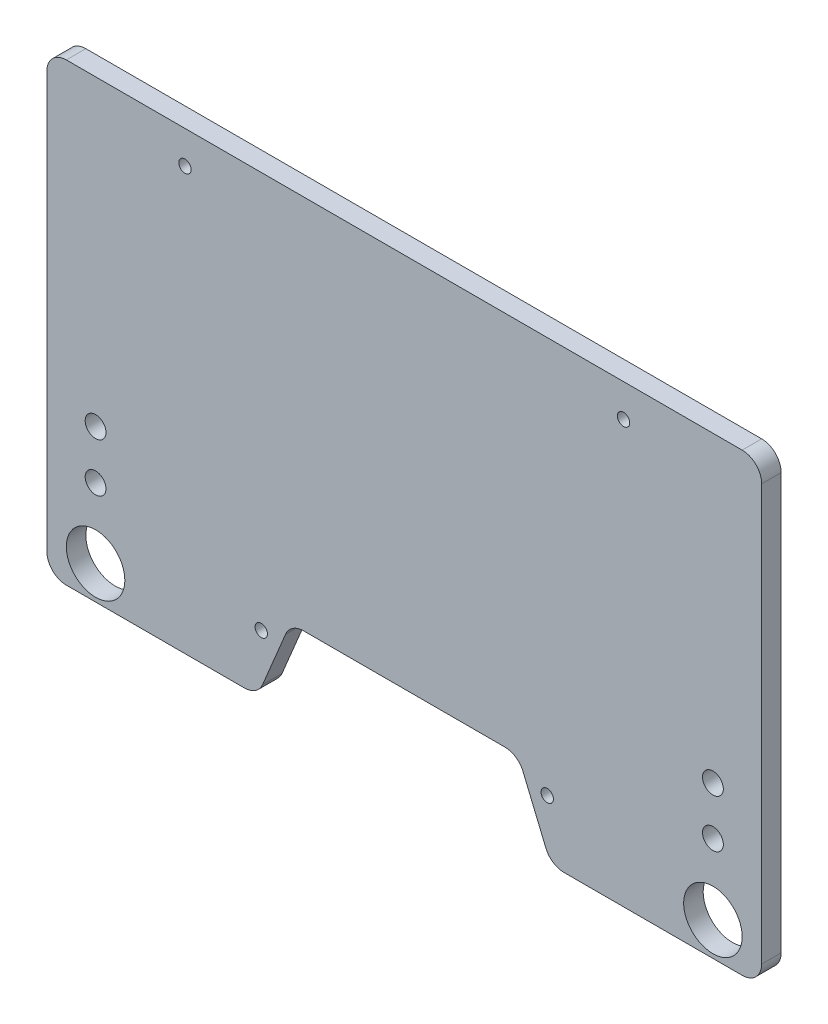
ISO-10303-21;
HEADER;
FILE_DESCRIPTION(('STEP AP214'),'2;1');
FILE_NAME('part.step','',(''),(''),'','','');
FILE_SCHEMA(('AUTOMOTIVE_DESIGN { 1 0 10303 214 1 1 1 1 }'));
ENDSEC;
DATA;
#1=APPLICATION_CONTEXT('core data for automotive mechanical design processes');
#2=APPLICATION_PROTOCOL_DEFINITION('international standard','automotive_design',2000,#1);
#3=PRODUCT_CONTEXT('',#1,'mechanical');
#4=PRODUCT('Part','Part','',(#3));
#5=PRODUCT_RELATED_PRODUCT_CATEGORY('part','',(#4));
#6=PRODUCT_DEFINITION_FORMATION('','',#4);
#7=PRODUCT_DEFINITION_CONTEXT('part definition',#1,'design');
#8=PRODUCT_DEFINITION('design','',#6,#7);
#9=PRODUCT_DEFINITION_SHAPE('','',#8);
#10=(LENGTH_UNIT() NAMED_UNIT(*) SI_UNIT(.MILLI.,.METRE.));
#11=(NAMED_UNIT(*) PLANE_ANGLE_UNIT() SI_UNIT($,.RADIAN.));
#12=(NAMED_UNIT(*) SI_UNIT($,.STERADIAN.) SOLID_ANGLE_UNIT());
#13=UNCERTAINTY_MEASURE_WITH_UNIT(LENGTH_MEASURE(1.E-05),#10,'distance_accuracy_value','');
#14=(GEOMETRIC_REPRESENTATION_CONTEXT(3) GLOBAL_UNCERTAINTY_ASSIGNED_CONTEXT((#13)) GLOBAL_UNIT_ASSIGNED_CONTEXT((#10,
#11,#12)) REPRESENTATION_CONTEXT('',''));
#15=CARTESIAN_POINT('',(0.,0.,0.));
#16=DIRECTION('',(0.,0.,1.));
#17=DIRECTION('',(1.,0.,0.));
#18=AXIS2_PLACEMENT_3D('',#15,#16,#17);
#19=CARTESIAN_POINT('',(99.5,78.1154273187962,3.));
#20=DIRECTION('',(0.,0.,-1.));
#21=DIRECTION('',(-1.,0.,0.));
#22=AXIS2_PLACEMENT_3D('',#19,#20,#21);
#23=PLANE('',#22);
#24=CARTESIAN_POINT('',(0.,16.2499999999968,3.));
#25=DIRECTION('',(0.,0.,1.));
#26=DIRECTION('',(1.,0.,0.));
#27=AXIS2_PLACEMENT_3D('',#24,#25,#26);
#28=CIRCLE('',#27,4.5);
#29=CARTESIAN_POINT('',(4.5,16.2499999999968,3.));
#30=VERTEX_POINT('',#29);
#31=EDGE_CURVE('E252',#30,#30,#28,.T.);
#32=ORIENTED_EDGE('',*,*,#31,.F.);
#33=EDGE_LOOP('',(#32));
#34=FACE_BOUND('',#33,.T.);
#35=CARTESIAN_POINT('',(95.,16.2499999999968,3.));
#36=DIRECTION('',(0.,0.,1.));
#37=DIRECTION('',(1.,0.,0.));
#38=AXIS2_PLACEMENT_3D('',#35,#36,#37);
#39=CIRCLE('',#38,4.5);
#40=CARTESIAN_POINT('',(99.5,16.2499999999968,3.));
#41=VERTEX_POINT('',#40);
#42=EDGE_CURVE('E258',#41,#41,#39,.T.);
#43=ORIENTED_EDGE('',*,*,#42,.F.);
#44=EDGE_LOOP('',(#43));
#45=FACE_BOUND('',#44,.T.);
#46=CARTESIAN_POINT('',(99.5,78.1154273187962,3.));
#47=DIRECTION('',(0.,0.,1.));
#48=DIRECTION('',(-1.,0.,0.));
#49=AXIS2_PLACEMENT_3D('',#46,#47,#48);
#50=CIRCLE('',#49,3.);
#51=CARTESIAN_POINT('',(102.5,78.1154273187962,3.));
#52=VERTEX_POINT('',#51);
#53=CARTESIAN_POINT('',(99.5,81.1154273187962,3.));
#54=VERTEX_POINT('',#53);
#55=EDGE_CURVE('E215',#52,#54,#50,.T.);
#56=ORIENTED_EDGE('',*,*,#55,.T.);
#57=DIRECTION('',(-1.,0.,0.));
#58=VECTOR('',#57,1.);
#59=CARTESIAN_POINT('',(-4.50000000000001,81.1154273187962,3.));
#60=LINE('',#59,#58);
#61=CARTESIAN_POINT('',(-4.50000000000001,81.1154273187962,3.));
#62=VERTEX_POINT('',#61);
#63=EDGE_CURVE('E121',#54,#62,#60,.T.);
#64=ORIENTED_EDGE('',*,*,#63,.T.);
#65=CARTESIAN_POINT('',(-4.50000000000001,78.1154273187962,3.));
#66=DIRECTION('',(0.,0.,1.));
#67=DIRECTION('',(1.,0.,0.));
#68=AXIS2_PLACEMENT_3D('',#65,#66,#67);
#69=CIRCLE('',#68,3.);
#70=CARTESIAN_POINT('',(-7.50000000000001,78.1154273187962,3.));
#71=VERTEX_POINT('',#70);
#72=EDGE_CURVE('E313',#62,#71,#69,.T.);
#73=ORIENTED_EDGE('',*,*,#72,.T.);
#74=DIRECTION('',(0.,-1.,0.));
#75=VECTOR('',#74,1.);
#76=CARTESIAN_POINT('',(-7.50000000000001,78.1154273187962,3.));
#77=LINE('',#76,#75);
#78=CARTESIAN_POINT('',(-7.5,14.1154273187962,3.));
#79=VERTEX_POINT('',#78);
#80=EDGE_CURVE('E315',#71,#79,#77,.T.);
#81=ORIENTED_EDGE('',*,*,#80,.T.);
#82=CARTESIAN_POINT('',(-4.5,14.1154273187962,3.));
#83=DIRECTION('',(0.,0.,1.));
#84=DIRECTION('',(1.,0.,0.));
#85=AXIS2_PLACEMENT_3D('',#82,#83,#84);
#86=CIRCLE('',#85,3.);
#87=CARTESIAN_POINT('',(-4.49999999999998,11.1154273187962,3.));
#88=VERTEX_POINT('',#87);
#89=EDGE_CURVE('E317',#79,#88,#86,.T.);
#90=ORIENTED_EDGE('',*,*,#89,.T.);
#91=DIRECTION('',(1.,0.,0.));
#92=VECTOR('',#91,1.);
#93=CARTESIAN_POINT('',(-4.49999999999998,11.1154273187962,3.));
#94=LINE('',#93,#92);
#95=CARTESIAN_POINT('',(22.9314636408157,11.1154273187962,3.));
#96=VERTEX_POINT('',#95);
#97=EDGE_CURVE('E319',#88,#96,#94,.T.);
#98=ORIENTED_EDGE('',*,*,#97,.T.);
#99=CARTESIAN_POINT('',(22.9314636408157,14.1154273187962,3.));
#100=DIRECTION('',(0.,0.,1.));
#101=DIRECTION('',(-1.,0.,0.));
#102=AXIS2_PLACEMENT_3D('',#99,#100,#101);
#103=CIRCLE('',#102,3.);
#104=CARTESIAN_POINT('',(25.7006944100464,12.9615811649499,3.));
#105=VERTEX_POINT('',#104);
#106=EDGE_CURVE('E321',#96,#105,#103,.T.);
#107=ORIENTED_EDGE('',*,*,#106,.T.);
#108=DIRECTION('',(0.384615384615421,0.923076923076908,0.));
#109=VECTOR('',#108,1.);
#110=CARTESIAN_POINT('',(28.2692307692299,19.1260684269896,3.));
#111=LINE('',#110,#109);
#112=CARTESIAN_POINT('',(29.2307692307699,21.4337607346855,3.));
#113=VERTEX_POINT('',#112);
#114=EDGE_CURVE('E323',#105,#113,#111,.T.);
#115=ORIENTED_EDGE('',*,*,#114,.T.);
#116=CARTESIAN_POINT('',(32.,20.2799145808375,3.));
#117=DIRECTION('',(0.,0.,-1.));
#118=DIRECTION('',(1.,0.,0.));
#119=AXIS2_PLACEMENT_3D('',#116,#117,#118);
#120=CIRCLE('',#119,3.00000000000002);
#121=CARTESIAN_POINT('',(32.,23.2799145808375,3.));
#122=VERTEX_POINT('',#121);
#123=EDGE_CURVE('E325',#113,#122,#120,.T.);
#124=ORIENTED_EDGE('',*,*,#123,.T.);
#125=DIRECTION('',(1.,0.,0.));
#126=VECTOR('',#125,1.);
#127=CARTESIAN_POINT('',(32.,23.2799145808375,3.));
#128=LINE('',#127,#126);
#129=CARTESIAN_POINT('',(63.,23.2799145808375,3.));
#130=VERTEX_POINT('',#129);
#131=EDGE_CURVE('E327',#122,#130,#128,.T.);
#132=ORIENTED_EDGE('',*,*,#131,.T.);
#133=CARTESIAN_POINT('',(63.,20.2799145808375,3.));
#134=DIRECTION('',(0.,0.,-1.));
#135=DIRECTION('',(1.,0.,0.));
#136=AXIS2_PLACEMENT_3D('',#133,#134,#135);
#137=CIRCLE('',#136,2.99999999999994);
#138=CARTESIAN_POINT('',(65.7692307692299,21.4337607346854,3.));
#139=VERTEX_POINT('',#138);
#140=EDGE_CURVE('E329',#130,#139,#137,.T.);
#141=ORIENTED_EDGE('',*,*,#140,.T.);
#142=DIRECTION('',(0.384615384615432,-0.923076923076903,0.));
#143=VECTOR('',#142,1.);
#144=CARTESIAN_POINT('',(65.7692307692299,21.4337607346854,3.));
#145=LINE('',#144,#143);
#146=CARTESIAN_POINT('',(69.2993055899535,12.9615811649499,3.));
#147=VERTEX_POINT('',#146);
#148=EDGE_CURVE('E331',#139,#147,#145,.T.);
#149=ORIENTED_EDGE('',*,*,#148,.T.);
#150=CARTESIAN_POINT('',(72.0685363591843,14.1154273187962,3.));
#151=DIRECTION('',(0.,0.,1.));
#152=DIRECTION('',(1.,0.,0.));
#153=AXIS2_PLACEMENT_3D('',#150,#151,#152);
#154=CIRCLE('',#153,3.);
#155=CARTESIAN_POINT('',(72.0685363591843,11.1154273187962,3.));
#156=VERTEX_POINT('',#155);
#157=EDGE_CURVE('E164',#147,#156,#154,.T.);
#158=ORIENTED_EDGE('',*,*,#157,.T.);
#159=DIRECTION('',(1.,0.,0.));
#160=VECTOR('',#159,1.);
#161=CARTESIAN_POINT('',(72.0685363591843,11.1154273187962,3.));
#162=LINE('',#161,#160);
#163=CARTESIAN_POINT('',(99.5,11.1154273187962,3.));
#164=VERTEX_POINT('',#163);
#165=EDGE_CURVE('E158',#156,#164,#162,.T.);
#166=ORIENTED_EDGE('',*,*,#165,.T.);
#167=CARTESIAN_POINT('',(99.5,14.1154273187962,3.));
#168=DIRECTION('',(0.,0.,1.));
#169=DIRECTION('',(1.,0.,0.));
#170=AXIS2_PLACEMENT_3D('',#167,#168,#169);
#171=CIRCLE('',#170,3.);
#172=CARTESIAN_POINT('',(102.5,14.1154273187962,3.));
#173=VERTEX_POINT('',#172);
#174=EDGE_CURVE('E162',#164,#173,#171,.T.);
#175=ORIENTED_EDGE('',*,*,#174,.T.);
#176=DIRECTION('',(0.,1.,0.));
#177=VECTOR('',#176,1.);
#178=CARTESIAN_POINT('',(102.5,78.1154273187962,3.));
#179=LINE('',#178,#177);
#180=EDGE_CURVE('E54',#173,#52,#179,.T.);
#181=ORIENTED_EDGE('',*,*,#180,.T.);
#182=EDGE_LOOP('',(#56,#64,#73,#81,#90,#98,#107,#115,#124,#132,#141,#149,#158,#166,#175,#181));
#183=FACE_BOUND('',#182,.T.);
#184=CARTESIAN_POINT('',(0.,34.4999999999959,3.));
#185=DIRECTION('',(0.,0.,1.));
#186=DIRECTION('',(1.,0.,0.));
#187=AXIS2_PLACEMENT_3D('',#184,#185,#186);
#188=CIRCLE('',#187,1.6);
#189=CARTESIAN_POINT('',(1.6,34.4999999999959,3.));
#190=VERTEX_POINT('',#189);
#191=EDGE_CURVE('E186',#190,#190,#188,.T.);
#192=ORIENTED_EDGE('',*,*,#191,.F.);
#193=EDGE_LOOP('',(#192));
#194=FACE_BOUND('',#193,.T.);
#195=CARTESIAN_POINT('',(0.,26.9999999999979,3.));
#196=DIRECTION('',(0.,0.,1.));
#197=DIRECTION('',(1.,0.,0.));
#198=AXIS2_PLACEMENT_3D('',#195,#196,#197);
#199=CIRCLE('',#198,1.6);
#200=CARTESIAN_POINT('',(1.6,26.9999999999979,3.));
#201=VERTEX_POINT('',#200);
#202=EDGE_CURVE('E301',#201,#201,#199,.T.);
#203=ORIENTED_EDGE('',*,*,#202,.F.);
#204=EDGE_LOOP('',(#203));
#205=FACE_BOUND('',#204,.T.);
#206=CARTESIAN_POINT('',(95.,34.4999999999959,3.));
#207=DIRECTION('',(0.,0.,1.));
#208=DIRECTION('',(1.,0.,0.));
#209=AXIS2_PLACEMENT_3D('',#206,#207,#208);
#210=CIRCLE('',#209,1.60000000000001);
#211=CARTESIAN_POINT('',(96.6,34.4999999999959,3.));
#212=VERTEX_POINT('',#211);
#213=EDGE_CURVE('E295',#212,#212,#210,.T.);
#214=ORIENTED_EDGE('',*,*,#213,.F.);
#215=EDGE_LOOP('',(#214));
#216=FACE_BOUND('',#215,.T.);
#217=CARTESIAN_POINT('',(95.,27.1000000000248,3.));
#218=DIRECTION('',(0.,0.,1.));
#219=DIRECTION('',(1.,0.,0.));
#220=AXIS2_PLACEMENT_3D('',#217,#218,#219);
#221=CIRCLE('',#220,1.6);
#222=CARTESIAN_POINT('',(96.6,27.1000000000248,3.));
#223=VERTEX_POINT('',#222);
#224=EDGE_CURVE('E289',#223,#223,#221,.T.);
#225=ORIENTED_EDGE('',*,*,#224,.F.);
#226=EDGE_LOOP('',(#225));
#227=FACE_BOUND('',#226,.T.);
#228=CARTESIAN_POINT('',(13.75,76.0799145808375,3.));
#229=DIRECTION('',(0.,0.,1.));
#230=DIRECTION('',(1.,0.,0.));
#231=AXIS2_PLACEMENT_3D('',#228,#229,#230);
#232=CIRCLE('',#231,0.950000000000001);
#233=CARTESIAN_POINT('',(14.7,76.0799145808375,3.));
#234=VERTEX_POINT('',#233);
#235=EDGE_CURVE('E283',#234,#234,#232,.T.);
#236=ORIENTED_EDGE('',*,*,#235,.F.);
#237=EDGE_LOOP('',(#236));
#238=FACE_BOUND('',#237,.T.);
#239=CARTESIAN_POINT('',(81.25,76.0799145808375,3.));
#240=DIRECTION('',(0.,0.,1.));
#241=DIRECTION('',(1.,0.,0.));
#242=AXIS2_PLACEMENT_3D('',#239,#240,#241);
#243=CIRCLE('',#242,0.950000000000003);
#244=CARTESIAN_POINT('',(82.2,76.0799145808375,3.));
#245=VERTEX_POINT('',#244);
#246=EDGE_CURVE('E277',#245,#245,#243,.T.);
#247=ORIENTED_EDGE('',*,*,#246,.F.);
#248=EDGE_LOOP('',(#247));
#249=FACE_BOUND('',#248,.T.);
#250=CARTESIAN_POINT('',(69.5,20.0799145808375,3.));
#251=DIRECTION('',(0.,0.,1.));
#252=DIRECTION('',(1.,0.,0.));
#253=AXIS2_PLACEMENT_3D('',#250,#251,#252);
#254=CIRCLE('',#253,0.950000000000002);
#255=CARTESIAN_POINT('',(70.45,20.0799145808375,3.));
#256=VERTEX_POINT('',#255);
#257=EDGE_CURVE('E271',#256,#256,#254,.T.);
#258=ORIENTED_EDGE('',*,*,#257,.F.);
#259=EDGE_LOOP('',(#258));
#260=FACE_BOUND('',#259,.T.);
#261=CARTESIAN_POINT('',(25.5,20.0799145808375,3.));
#262=DIRECTION('',(0.,0.,1.));
#263=DIRECTION('',(1.,0.,0.));
#264=AXIS2_PLACEMENT_3D('',#261,#262,#263);
#265=CIRCLE('',#264,0.950000000000001);
#266=CARTESIAN_POINT('',(26.45,20.0799145808375,3.));
#267=VERTEX_POINT('',#266);
#268=EDGE_CURVE('E265',#267,#267,#265,.T.);
#269=ORIENTED_EDGE('',*,*,#268,.F.);
#270=EDGE_LOOP('',(#269));
#271=FACE_BOUND('',#270,.T.);
#272=ADVANCED_FACE('F35',(#34,#45,#183,#194,#205,#216,#227,#238,#249,#260,#271),#23,.F.);
#273=CARTESIAN_POINT('',(99.5,78.1154273187962,0.));
#274=DIRECTION('',(0.,0.,-1.));
#275=DIRECTION('',(-1.,0.,0.));
#276=AXIS2_PLACEMENT_3D('',#273,#274,#275);
#277=PLANE('',#276);
#278=CARTESIAN_POINT('',(0.,16.2499999999968,0.));
#279=DIRECTION('',(0.,0.,-1.));
#280=DIRECTION('',(-1.,0.,0.));
#281=AXIS2_PLACEMENT_3D('',#278,#279,#280);
#282=CIRCLE('',#281,4.5);
#283=CARTESIAN_POINT('',(-4.5,16.2499999999968,0.));
#284=VERTEX_POINT('',#283);
#285=EDGE_CURVE('E39',#284,#284,#282,.T.);
#286=ORIENTED_EDGE('',*,*,#285,.F.);
#287=EDGE_LOOP('',(#286));
#288=FACE_BOUND('',#287,.T.);
#289=CARTESIAN_POINT('',(95.,16.2499999999968,0.));
#290=DIRECTION('',(0.,0.,-1.));
#291=DIRECTION('',(-1.,0.,0.));
#292=AXIS2_PLACEMENT_3D('',#289,#290,#291);
#293=CIRCLE('',#292,4.5);
#294=CARTESIAN_POINT('',(90.5,16.2499999999968,0.));
#295=VERTEX_POINT('',#294);
#296=EDGE_CURVE('E250',#295,#295,#293,.T.);
#297=ORIENTED_EDGE('',*,*,#296,.F.);
#298=EDGE_LOOP('',(#297));
#299=FACE_BOUND('',#298,.T.);
#300=CARTESIAN_POINT('',(69.5,20.0799145808375,0.));
#301=DIRECTION('',(0.,0.,1.));
#302=DIRECTION('',(1.,0.,0.));
#303=AXIS2_PLACEMENT_3D('',#300,#301,#302);
#304=CIRCLE('',#303,0.950000000000002);
#305=CARTESIAN_POINT('',(70.45,20.0799145808375,0.));
#306=VERTEX_POINT('',#305);
#307=EDGE_CURVE('E268',#306,#306,#304,.T.);
#308=ORIENTED_EDGE('',*,*,#307,.T.);
#309=EDGE_LOOP('',(#308));
#310=FACE_BOUND('',#309,.T.);
#311=CARTESIAN_POINT('',(13.75,76.0799145808375,0.));
#312=DIRECTION('',(0.,0.,1.));
#313=DIRECTION('',(1.,0.,0.));
#314=AXIS2_PLACEMENT_3D('',#311,#312,#313);
#315=CIRCLE('',#314,0.950000000000001);
#316=CARTESIAN_POINT('',(14.7,76.0799145808375,0.));
#317=VERTEX_POINT('',#316);
#318=EDGE_CURVE('E280',#317,#317,#315,.T.);
#319=ORIENTED_EDGE('',*,*,#318,.T.);
#320=EDGE_LOOP('',(#319));
#321=FACE_BOUND('',#320,.T.);
#322=CARTESIAN_POINT('',(95.,34.4999999999959,0.));
#323=DIRECTION('',(0.,0.,1.));
#324=DIRECTION('',(1.,0.,0.));
#325=AXIS2_PLACEMENT_3D('',#322,#323,#324);
#326=CIRCLE('',#325,1.60000000000001);
#327=CARTESIAN_POINT('',(96.6,34.4999999999959,0.));
#328=VERTEX_POINT('',#327);
#329=EDGE_CURVE('E292',#328,#328,#326,.T.);
#330=ORIENTED_EDGE('',*,*,#329,.T.);
#331=EDGE_LOOP('',(#330));
#332=FACE_BOUND('',#331,.T.);
#333=CARTESIAN_POINT('',(0.,34.4999999999959,0.));
#334=DIRECTION('',(0.,0.,1.));
#335=DIRECTION('',(1.,0.,0.));
#336=AXIS2_PLACEMENT_3D('',#333,#334,#335);
#337=CIRCLE('',#336,1.6);
#338=CARTESIAN_POINT('',(1.6,34.4999999999959,0.));
#339=VERTEX_POINT('',#338);
#340=EDGE_CURVE('E304',#339,#339,#337,.T.);
#341=ORIENTED_EDGE('',*,*,#340,.T.);
#342=EDGE_LOOP('',(#341));
#343=FACE_BOUND('',#342,.T.);
#344=CARTESIAN_POINT('',(99.5,78.1154273187962,0.));
#345=DIRECTION('',(0.,0.,1.));
#346=DIRECTION('',(-1.,0.,0.));
#347=AXIS2_PLACEMENT_3D('',#344,#345,#346);
#348=CIRCLE('',#347,3.);
#349=CARTESIAN_POINT('',(102.5,78.1154273187962,0.));
#350=VERTEX_POINT('',#349);
#351=CARTESIAN_POINT('',(99.5,81.1154273187962,0.));
#352=VERTEX_POINT('',#351);
#353=EDGE_CURVE('E182',#350,#352,#348,.T.);
#354=ORIENTED_EDGE('',*,*,#353,.F.);
#355=DIRECTION('',(0.,1.,0.));
#356=VECTOR('',#355,1.);
#357=CARTESIAN_POINT('',(102.5,78.1154273187962,0.));
#358=LINE('',#357,#356);
#359=CARTESIAN_POINT('',(102.5,14.1154273187962,0.));
#360=VERTEX_POINT('',#359);
#361=EDGE_CURVE('E113',#360,#350,#358,.T.);
#362=ORIENTED_EDGE('',*,*,#361,.F.);
#363=CARTESIAN_POINT('',(99.5,14.1154273187962,0.));
#364=DIRECTION('',(0.,0.,1.));
#365=DIRECTION('',(1.,0.,0.));
#366=AXIS2_PLACEMENT_3D('',#363,#364,#365);
#367=CIRCLE('',#366,3.);
#368=CARTESIAN_POINT('',(99.5,11.1154273187962,0.));
#369=VERTEX_POINT('',#368);
#370=EDGE_CURVE('E107',#369,#360,#367,.T.);
#371=ORIENTED_EDGE('',*,*,#370,.F.);
#372=DIRECTION('',(1.,0.,0.));
#373=VECTOR('',#372,1.);
#374=CARTESIAN_POINT('',(72.0685363591843,11.1154273187962,0.));
#375=LINE('',#374,#373);
#376=CARTESIAN_POINT('',(72.0685363591843,11.1154273187962,0.));
#377=VERTEX_POINT('',#376);
#378=EDGE_CURVE('E172',#377,#369,#375,.T.);
#379=ORIENTED_EDGE('',*,*,#378,.F.);
#380=CARTESIAN_POINT('',(72.0685363591843,14.1154273187962,0.));
#381=DIRECTION('',(0.,0.,1.));
#382=DIRECTION('',(1.,0.,0.));
#383=AXIS2_PLACEMENT_3D('',#380,#381,#382);
#384=CIRCLE('',#383,3.);
#385=CARTESIAN_POINT('',(69.2993055899535,12.9615811649499,0.));
#386=VERTEX_POINT('',#385);
#387=EDGE_CURVE('E210',#386,#377,#384,.T.);
#388=ORIENTED_EDGE('',*,*,#387,.F.);
#389=DIRECTION('',(0.384615384615432,-0.923076923076903,0.));
#390=VECTOR('',#389,1.);
#391=CARTESIAN_POINT('',(66.7307692307682,19.1260684269938,0.));
#392=LINE('',#391,#390);
#393=CARTESIAN_POINT('',(65.7692307692299,21.4337607346854,0.));
#394=VERTEX_POINT('',#393);
#395=EDGE_CURVE('E208',#394,#386,#392,.T.);
#396=ORIENTED_EDGE('',*,*,#395,.F.);
#397=CARTESIAN_POINT('',(63.,20.2799145808375,0.));
#398=DIRECTION('',(0.,0.,-1.));
#399=DIRECTION('',(1.,0.,0.));
#400=AXIS2_PLACEMENT_3D('',#397,#398,#399);
#401=CIRCLE('',#400,2.99999999999994);
#402=CARTESIAN_POINT('',(63.,23.2799145808375,0.));
#403=VERTEX_POINT('',#402);
#404=EDGE_CURVE('E205',#403,#394,#401,.T.);
#405=ORIENTED_EDGE('',*,*,#404,.F.);
#406=DIRECTION('',(1.,0.,0.));
#407=VECTOR('',#406,1.);
#408=CARTESIAN_POINT('',(32.,23.2799145808375,0.));
#409=LINE('',#408,#407);
#410=CARTESIAN_POINT('',(32.,23.2799145808375,0.));
#411=VERTEX_POINT('',#410);
#412=EDGE_CURVE('E203',#411,#403,#409,.T.);
#413=ORIENTED_EDGE('',*,*,#412,.F.);
#414=CARTESIAN_POINT('',(32.,20.2799145808375,0.));
#415=DIRECTION('',(0.,0.,-1.));
#416=DIRECTION('',(1.,0.,0.));
#417=AXIS2_PLACEMENT_3D('',#414,#415,#416);
#418=CIRCLE('',#417,3.00000000000002);
#419=CARTESIAN_POINT('',(29.2307692307699,21.4337607346855,0.));
#420=VERTEX_POINT('',#419);
#421=EDGE_CURVE('E201',#420,#411,#418,.T.);
#422=ORIENTED_EDGE('',*,*,#421,.F.);
#423=DIRECTION('',(0.384615384615422,0.923076923076908,0.));
#424=VECTOR('',#423,1.);
#425=CARTESIAN_POINT('',(28.2692307692299,19.1260684269896,0.));
#426=LINE('',#425,#424);
#427=CARTESIAN_POINT('',(25.7006944100464,12.9615811649499,0.));
#428=VERTEX_POINT('',#427);
#429=EDGE_CURVE('E199',#428,#420,#426,.T.);
#430=ORIENTED_EDGE('',*,*,#429,.F.);
#431=CARTESIAN_POINT('',(22.9314636408157,14.1154273187962,0.));
#432=DIRECTION('',(0.,0.,1.));
#433=DIRECTION('',(-1.,0.,0.));
#434=AXIS2_PLACEMENT_3D('',#431,#432,#433);
#435=CIRCLE('',#434,3.);
#436=CARTESIAN_POINT('',(22.9314636408157,11.1154273187962,0.));
#437=VERTEX_POINT('',#436);
#438=EDGE_CURVE('E196',#437,#428,#435,.T.);
#439=ORIENTED_EDGE('',*,*,#438,.F.);
#440=DIRECTION('',(1.,0.,0.));
#441=VECTOR('',#440,1.);
#442=CARTESIAN_POINT('',(-4.49999999999998,11.1154273187962,0.));
#443=LINE('',#442,#441);
#444=CARTESIAN_POINT('',(-4.49999999999998,11.1154273187962,0.));
#445=VERTEX_POINT('',#444);
#446=EDGE_CURVE('E194',#445,#437,#443,.T.);
#447=ORIENTED_EDGE('',*,*,#446,.F.);
#448=CARTESIAN_POINT('',(-4.5,14.1154273187962,0.));
#449=DIRECTION('',(0.,0.,1.));
#450=DIRECTION('',(1.,0.,0.));
#451=AXIS2_PLACEMENT_3D('',#448,#449,#450);
#452=CIRCLE('',#451,3.);
#453=CARTESIAN_POINT('',(-7.5,14.1154273187962,0.));
#454=VERTEX_POINT('',#453);
#455=EDGE_CURVE('E192',#454,#445,#452,.T.);
#456=ORIENTED_EDGE('',*,*,#455,.F.);
#457=DIRECTION('',(0.,-1.,0.));
#458=VECTOR('',#457,1.);
#459=CARTESIAN_POINT('',(-7.50000000000001,78.1154273187962,0.));
#460=LINE('',#459,#458);
#461=CARTESIAN_POINT('',(-7.50000000000001,78.1154273187962,0.));
#462=VERTEX_POINT('',#461);
#463=EDGE_CURVE('E190',#462,#454,#460,.T.);
#464=ORIENTED_EDGE('',*,*,#463,.F.);
#465=CARTESIAN_POINT('',(-4.50000000000001,78.1154273187962,0.));
#466=DIRECTION('',(0.,0.,1.));
#467=DIRECTION('',(1.,0.,0.));
#468=AXIS2_PLACEMENT_3D('',#465,#466,#467);
#469=CIRCLE('',#468,3.);
#470=CARTESIAN_POINT('',(-4.50000000000001,81.1154273187962,0.));
#471=VERTEX_POINT('',#470);
#472=EDGE_CURVE('E188',#471,#462,#469,.T.);
#473=ORIENTED_EDGE('',*,*,#472,.F.);
#474=DIRECTION('',(-1.,0.,0.));
#475=VECTOR('',#474,1.);
#476=CARTESIAN_POINT('',(-4.50000000000001,81.1154273187962,0.));
#477=LINE('',#476,#475);
#478=EDGE_CURVE('E185',#352,#471,#477,.T.);
#479=ORIENTED_EDGE('',*,*,#478,.F.);
#480=EDGE_LOOP('',(#354,#362,#371,#379,#388,#396,#405,#413,#422,#430,#439,#447,#456,#464,#473,#479));
#481=FACE_BOUND('',#480,.T.);
#482=CARTESIAN_POINT('',(0.,26.9999999999979,0.));
#483=DIRECTION('',(0.,0.,1.));
#484=DIRECTION('',(1.,0.,0.));
#485=AXIS2_PLACEMENT_3D('',#482,#483,#484);
#486=CIRCLE('',#485,1.6);
#487=CARTESIAN_POINT('',(1.6,26.9999999999979,0.));
#488=VERTEX_POINT('',#487);
#489=EDGE_CURVE('E298',#488,#488,#486,.T.);
#490=ORIENTED_EDGE('',*,*,#489,.T.);
#491=EDGE_LOOP('',(#490));
#492=FACE_BOUND('',#491,.T.);
#493=CARTESIAN_POINT('',(95.,27.1000000000248,0.));
#494=DIRECTION('',(0.,0.,1.));
#495=DIRECTION('',(1.,0.,0.));
#496=AXIS2_PLACEMENT_3D('',#493,#494,#495);
#497=CIRCLE('',#496,1.6);
#498=CARTESIAN_POINT('',(96.6,27.1000000000248,0.));
#499=VERTEX_POINT('',#498);
#500=EDGE_CURVE('E286',#499,#499,#497,.T.);
#501=ORIENTED_EDGE('',*,*,#500,.T.);
#502=EDGE_LOOP('',(#501));
#503=FACE_BOUND('',#502,.T.);
#504=CARTESIAN_POINT('',(81.25,76.0799145808375,0.));
#505=DIRECTION('',(0.,0.,1.));
#506=DIRECTION('',(1.,0.,0.));
#507=AXIS2_PLACEMENT_3D('',#504,#505,#506);
#508=CIRCLE('',#507,0.950000000000003);
#509=CARTESIAN_POINT('',(82.2,76.0799145808375,0.));
#510=VERTEX_POINT('',#509);
#511=EDGE_CURVE('E274',#510,#510,#508,.T.);
#512=ORIENTED_EDGE('',*,*,#511,.T.);
#513=EDGE_LOOP('',(#512));
#514=FACE_BOUND('',#513,.T.);
#515=CARTESIAN_POINT('',(25.5,20.0799145808375,0.));
#516=DIRECTION('',(0.,0.,1.));
#517=DIRECTION('',(1.,0.,0.));
#518=AXIS2_PLACEMENT_3D('',#515,#516,#517);
#519=CIRCLE('',#518,0.950000000000001);
#520=CARTESIAN_POINT('',(26.45,20.0799145808375,0.));
#521=VERTEX_POINT('',#520);
#522=EDGE_CURVE('E256',#521,#521,#519,.T.);
#523=ORIENTED_EDGE('',*,*,#522,.T.);
#524=EDGE_LOOP('',(#523));
#525=FACE_BOUND('',#524,.T.);
#526=ADVANCED_FACE('F343',(#288,#299,#310,#321,#332,#343,#481,#492,#503,#514,#525),#277,.T.);
#527=CARTESIAN_POINT('',(99.5,78.1154273187962,3.));
#528=DIRECTION('',(0.,0.,-1.));
#529=DIRECTION('',(-1.,0.,0.));
#530=AXIS2_PLACEMENT_3D('',#527,#528,#529);
#531=CYLINDRICAL_SURFACE('',#530,3.);
#532=ORIENTED_EDGE('',*,*,#353,.T.);
#533=DIRECTION('',(0.,0.,-1.));
#534=VECTOR('',#533,1.);
#535=CARTESIAN_POINT('',(99.5,81.1154273187962,3.));
#536=LINE('',#535,#534);
#537=EDGE_CURVE('E11',#54,#352,#536,.T.);
#538=ORIENTED_EDGE('',*,*,#537,.F.);
#539=ORIENTED_EDGE('',*,*,#55,.F.);
#540=DIRECTION('',(0.,0.,-1.));
#541=VECTOR('',#540,1.);
#542=CARTESIAN_POINT('',(102.5,78.1154273187962,3.));
#543=LINE('',#542,#541);
#544=EDGE_CURVE('E178',#52,#350,#543,.T.);
#545=ORIENTED_EDGE('',*,*,#544,.T.);
#546=EDGE_LOOP('',(#532,#538,#539,#545));
#547=FACE_BOUND('',#546,.T.);
#548=ADVANCED_FACE('F37',(#547),#531,.T.);
#549=CARTESIAN_POINT('',(-4.50000000000001,81.1154273187962,3.));
#550=DIRECTION('',(0.,-1.,0.));
#551=DIRECTION('',(0.,0.,-1.));
#552=AXIS2_PLACEMENT_3D('',#549,#550,#551);
#553=PLANE('',#552);
#554=ORIENTED_EDGE('',*,*,#478,.T.);
#555=DIRECTION('',(0.,0.,-1.));
#556=VECTOR('',#555,1.);
#557=CARTESIAN_POINT('',(-4.50000000000001,81.1154273187962,3.));
#558=LINE('',#557,#556);
#559=EDGE_CURVE('E45',#62,#471,#558,.T.);
#560=ORIENTED_EDGE('',*,*,#559,.F.);
#561=ORIENTED_EDGE('',*,*,#63,.F.);
#562=ORIENTED_EDGE('',*,*,#537,.T.);
#563=EDGE_LOOP('',(#554,#560,#561,#562));
#564=FACE_BOUND('',#563,.T.);
#565=ADVANCED_FACE('F582',(#564),#553,.F.);
#566=CARTESIAN_POINT('',(-4.50000000000001,78.1154273187962,3.));
#567=DIRECTION('',(0.,0.,-1.));
#568=DIRECTION('',(-1.,0.,0.));
#569=AXIS2_PLACEMENT_3D('',#566,#567,#568);
#570=CYLINDRICAL_SURFACE('',#569,3.);
#571=ORIENTED_EDGE('',*,*,#472,.T.);
#572=DIRECTION('',(0.,0.,-1.));
#573=VECTOR('',#572,1.);
#574=CARTESIAN_POINT('',(-7.50000000000001,78.1154273187962,3.));
#575=LINE('',#574,#573);
#576=EDGE_CURVE('E246',#71,#462,#575,.T.);
#577=ORIENTED_EDGE('',*,*,#576,.F.);
#578=ORIENTED_EDGE('',*,*,#72,.F.);
#579=ORIENTED_EDGE('',*,*,#559,.T.);
#580=EDGE_LOOP('',(#571,#577,#578,#579));
#581=FACE_BOUND('',#580,.T.);
#582=ADVANCED_FACE('F572',(#581),#570,.T.);
#583=CARTESIAN_POINT('',(-7.50000000000001,78.1154273187962,3.));
#584=DIRECTION('',(1.,0.,0.));
#585=DIRECTION('',(0.,1.,0.));
#586=AXIS2_PLACEMENT_3D('',#583,#584,#585);
#587=PLANE('',#586);
#588=ORIENTED_EDGE('',*,*,#463,.T.);
#589=DIRECTION('',(0.,0.,-1.));
#590=VECTOR('',#589,1.);
#591=CARTESIAN_POINT('',(-7.5,14.1154273187962,3.));
#592=LINE('',#591,#590);
#593=EDGE_CURVE('E243',#79,#454,#592,.T.);
#594=ORIENTED_EDGE('',*,*,#593,.F.);
#595=ORIENTED_EDGE('',*,*,#80,.F.);
#596=ORIENTED_EDGE('',*,*,#576,.T.);
#597=EDGE_LOOP('',(#588,#594,#595,#596));
#598=FACE_BOUND('',#597,.T.);
#599=ADVANCED_FACE('F562',(#598),#587,.F.);
#600=CARTESIAN_POINT('',(-4.5,14.1154273187962,3.));
#601=DIRECTION('',(0.,0.,-1.));
#602=DIRECTION('',(-1.,0.,0.));
#603=AXIS2_PLACEMENT_3D('',#600,#601,#602);
#604=CYLINDRICAL_SURFACE('',#603,3.);
#605=ORIENTED_EDGE('',*,*,#455,.T.);
#606=DIRECTION('',(0.,0.,-1.));
#607=VECTOR('',#606,1.);
#608=CARTESIAN_POINT('',(-4.49999999999998,11.1154273187962,3.));
#609=LINE('',#608,#607);
#610=EDGE_CURVE('E240',#88,#445,#609,.T.);
#611=ORIENTED_EDGE('',*,*,#610,.F.);
#612=ORIENTED_EDGE('',*,*,#89,.F.);
#613=ORIENTED_EDGE('',*,*,#593,.T.);
#614=EDGE_LOOP('',(#605,#611,#612,#613));
#615=FACE_BOUND('',#614,.T.);
#616=ADVANCED_FACE('F552',(#615),#604,.T.);
#617=CARTESIAN_POINT('',(-4.49999999999998,11.1154273187962,3.));
#618=DIRECTION('',(0.,1.,0.));
#619=DIRECTION('',(0.,0.,1.));
#620=AXIS2_PLACEMENT_3D('',#617,#618,#619);
#621=PLANE('',#620);
#622=ORIENTED_EDGE('',*,*,#446,.T.);
#623=DIRECTION('',(0.,0.,-1.));
#624=VECTOR('',#623,1.);
#625=CARTESIAN_POINT('',(22.9314636408157,11.1154273187962,3.));
#626=LINE('',#625,#624);
#627=EDGE_CURVE('E237',#96,#437,#626,.T.);
#628=ORIENTED_EDGE('',*,*,#627,.F.);
#629=ORIENTED_EDGE('',*,*,#97,.F.);
#630=ORIENTED_EDGE('',*,*,#610,.T.);
#631=EDGE_LOOP('',(#622,#628,#629,#630));
#632=FACE_BOUND('',#631,.T.);
#633=ADVANCED_FACE('F542',(#632),#621,.F.);
#634=CARTESIAN_POINT('',(22.9314636408157,14.1154273187962,3.));
#635=DIRECTION('',(0.,0.,-1.));
#636=DIRECTION('',(-1.,0.,0.));
#637=AXIS2_PLACEMENT_3D('',#634,#635,#636);
#638=CYLINDRICAL_SURFACE('',#637,3.);
#639=ORIENTED_EDGE('',*,*,#438,.T.);
#640=DIRECTION('',(0.,0.,-1.));
#641=VECTOR('',#640,1.);
#642=CARTESIAN_POINT('',(25.7006944100464,12.9615811649499,3.));
#643=LINE('',#642,#641);
#644=EDGE_CURVE('E234',#105,#428,#643,.T.);
#645=ORIENTED_EDGE('',*,*,#644,.F.);
#646=ORIENTED_EDGE('',*,*,#106,.F.);
#647=ORIENTED_EDGE('',*,*,#627,.T.);
#648=EDGE_LOOP('',(#639,#645,#646,#647));
#649=FACE_BOUND('',#648,.T.);
#650=ADVANCED_FACE('F531',(#649),#638,.T.);
#651=CARTESIAN_POINT('',(28.2692307692299,19.1260684269896,3.));
#652=DIRECTION('',(-0.923076923076907,0.384615384615422,0.));
#653=DIRECTION('',(-0.384615384615422,-0.923076923076907,0.));
#654=AXIS2_PLACEMENT_3D('',#651,#652,#653);
#655=PLANE('',#654);
#656=ORIENTED_EDGE('',*,*,#429,.T.);
#657=DIRECTION('',(0.,0.,-1.));
#658=VECTOR('',#657,1.);
#659=CARTESIAN_POINT('',(29.2307692307699,21.4337607346855,3.));
#660=LINE('',#659,#658);
#661=EDGE_CURVE('E231',#113,#420,#660,.T.);
#662=ORIENTED_EDGE('',*,*,#661,.F.);
#663=ORIENTED_EDGE('',*,*,#114,.F.);
#664=ORIENTED_EDGE('',*,*,#644,.T.);
#665=EDGE_LOOP('',(#656,#662,#663,#664));
#666=FACE_BOUND('',#665,.T.);
#667=ADVANCED_FACE('F521',(#666),#655,.F.);
#668=CARTESIAN_POINT('',(32.,20.2799145808375,3.));
#669=DIRECTION('',(0.,0.,-1.));
#670=DIRECTION('',(-1.,0.,0.));
#671=AXIS2_PLACEMENT_3D('',#668,#669,#670);
#672=CYLINDRICAL_SURFACE('',#671,3.00000000000002);
#673=ORIENTED_EDGE('',*,*,#421,.T.);
#674=DIRECTION('',(0.,0.,-1.));
#675=VECTOR('',#674,1.);
#676=CARTESIAN_POINT('',(32.,23.2799145808375,3.));
#677=LINE('',#676,#675);
#678=EDGE_CURVE('E228',#122,#411,#677,.T.);
#679=ORIENTED_EDGE('',*,*,#678,.F.);
#680=ORIENTED_EDGE('',*,*,#123,.F.);
#681=ORIENTED_EDGE('',*,*,#661,.T.);
#682=EDGE_LOOP('',(#673,#679,#680,#681));
#683=FACE_BOUND('',#682,.T.);
#684=ADVANCED_FACE('F511',(#683),#672,.F.);
#685=CARTESIAN_POINT('',(32.,23.2799145808375,3.));
#686=DIRECTION('',(0.,1.,0.));
#687=DIRECTION('',(0.,0.,1.));
#688=AXIS2_PLACEMENT_3D('',#685,#686,#687);
#689=PLANE('',#688);
#690=ORIENTED_EDGE('',*,*,#412,.T.);
#691=DIRECTION('',(0.,0.,-1.));
#692=VECTOR('',#691,1.);
#693=CARTESIAN_POINT('',(63.,23.2799145808375,3.));
#694=LINE('',#693,#692);
#695=EDGE_CURVE('E225',#130,#403,#694,.T.);
#696=ORIENTED_EDGE('',*,*,#695,.F.);
#697=ORIENTED_EDGE('',*,*,#131,.F.);
#698=ORIENTED_EDGE('',*,*,#678,.T.);
#699=EDGE_LOOP('',(#690,#696,#697,#698));
#700=FACE_BOUND('',#699,.T.);
#701=ADVANCED_FACE('F501',(#700),#689,.F.);
#702=CARTESIAN_POINT('',(63.,20.2799145808375,3.));
#703=DIRECTION('',(0.,0.,-1.));
#704=DIRECTION('',(-1.,0.,0.));
#705=AXIS2_PLACEMENT_3D('',#702,#703,#704);
#706=CYLINDRICAL_SURFACE('',#705,2.99999999999994);
#707=ORIENTED_EDGE('',*,*,#404,.T.);
#708=DIRECTION('',(0.,0.,-1.));
#709=VECTOR('',#708,1.);
#710=CARTESIAN_POINT('',(65.7692307692299,21.4337607346854,3.));
#711=LINE('',#710,#709);
#712=EDGE_CURVE('E222',#139,#394,#711,.T.);
#713=ORIENTED_EDGE('',*,*,#712,.F.);
#714=ORIENTED_EDGE('',*,*,#140,.F.);
#715=ORIENTED_EDGE('',*,*,#695,.T.);
#716=EDGE_LOOP('',(#707,#713,#714,#715));
#717=FACE_BOUND('',#716,.T.);
#718=ADVANCED_FACE('F491',(#717),#706,.F.);
#719=CARTESIAN_POINT('',(66.7307692307682,19.1260684269938,3.));
#720=DIRECTION('',(0.923076923076903,0.384615384615432,0.));
#721=DIRECTION('',(-0.384615384615432,0.923076923076903,0.));
#722=AXIS2_PLACEMENT_3D('',#719,#720,#721);
#723=PLANE('',#722);
#724=ORIENTED_EDGE('',*,*,#395,.T.);
#725=DIRECTION('',(0.,0.,-1.));
#726=VECTOR('',#725,1.);
#727=CARTESIAN_POINT('',(69.2993055899535,12.9615811649499,3.));
#728=LINE('',#727,#726);
#729=EDGE_CURVE('E219',#147,#386,#728,.T.);
#730=ORIENTED_EDGE('',*,*,#729,.F.);
#731=ORIENTED_EDGE('',*,*,#148,.F.);
#732=ORIENTED_EDGE('',*,*,#712,.T.);
#733=EDGE_LOOP('',(#724,#730,#731,#732));
#734=FACE_BOUND('',#733,.T.);
#735=ADVANCED_FACE('F337',(#734),#723,.F.);
#736=CARTESIAN_POINT('',(72.0685363591843,14.1154273187962,3.));
#737=DIRECTION('',(0.,0.,-1.));
#738=DIRECTION('',(-1.,0.,0.));
#739=AXIS2_PLACEMENT_3D('',#736,#737,#738);
#740=CYLINDRICAL_SURFACE('',#739,3.);
#741=ORIENTED_EDGE('',*,*,#387,.T.);
#742=DIRECTION('',(0.,0.,-1.));
#743=VECTOR('',#742,1.);
#744=CARTESIAN_POINT('',(72.0685363591843,11.1154273187962,3.));
#745=LINE('',#744,#743);
#746=EDGE_CURVE('E173',#156,#377,#745,.T.);
#747=ORIENTED_EDGE('',*,*,#746,.F.);
#748=ORIENTED_EDGE('',*,*,#157,.F.);
#749=ORIENTED_EDGE('',*,*,#729,.T.);
#750=EDGE_LOOP('',(#741,#747,#748,#749));
#751=FACE_BOUND('',#750,.T.);
#752=ADVANCED_FACE('F340',(#751),#740,.T.);
#753=CARTESIAN_POINT('',(72.0685363591843,11.1154273187962,3.));
#754=DIRECTION('',(0.,1.,0.));
#755=DIRECTION('',(-1.,0.,0.));
#756=AXIS2_PLACEMENT_3D('',#753,#754,#755);
#757=PLANE('',#756);
#758=ORIENTED_EDGE('',*,*,#378,.T.);
#759=DIRECTION('',(0.,0.,-1.));
#760=VECTOR('',#759,1.);
#761=CARTESIAN_POINT('',(99.5,11.1154273187962,3.));
#762=LINE('',#761,#760);
#763=EDGE_CURVE('E169',#164,#369,#762,.T.);
#764=ORIENTED_EDGE('',*,*,#763,.F.);
#765=ORIENTED_EDGE('',*,*,#165,.F.);
#766=ORIENTED_EDGE('',*,*,#746,.T.);
#767=EDGE_LOOP('',(#758,#764,#765,#766));
#768=FACE_BOUND('',#767,.T.);
#769=ADVANCED_FACE('F170',(#768),#757,.F.);
#770=CARTESIAN_POINT('',(99.5,14.1154273187962,3.));
#771=DIRECTION('',(0.,0.,-1.));
#772=DIRECTION('',(-1.,0.,0.));
#773=AXIS2_PLACEMENT_3D('',#770,#771,#772);
#774=CYLINDRICAL_SURFACE('',#773,3.);
#775=ORIENTED_EDGE('',*,*,#370,.T.);
#776=DIRECTION('',(0.,0.,-1.));
#777=VECTOR('',#776,1.);
#778=CARTESIAN_POINT('',(102.5,14.1154273187962,3.));
#779=LINE('',#778,#777);
#780=EDGE_CURVE('E174',#173,#360,#779,.T.);
#781=ORIENTED_EDGE('',*,*,#780,.F.);
#782=ORIENTED_EDGE('',*,*,#174,.F.);
#783=ORIENTED_EDGE('',*,*,#763,.T.);
#784=EDGE_LOOP('',(#775,#781,#782,#783));
#785=FACE_BOUND('',#784,.T.);
#786=ADVANCED_FACE('F176',(#785),#774,.T.);
#787=CARTESIAN_POINT('',(102.5,78.1154273187962,3.));
#788=DIRECTION('',(-1.,0.,0.));
#789=DIRECTION('',(0.,-1.,0.));
#790=AXIS2_PLACEMENT_3D('',#787,#788,#789);
#791=PLANE('',#790);
#792=ORIENTED_EDGE('',*,*,#361,.T.);
#793=ORIENTED_EDGE('',*,*,#544,.F.);
#794=ORIENTED_EDGE('',*,*,#180,.F.);
#795=ORIENTED_EDGE('',*,*,#780,.T.);
#796=EDGE_LOOP('',(#792,#793,#794,#795));
#797=FACE_BOUND('',#796,.T.);
#798=ADVANCED_FACE('F349',(#797),#791,.F.);
#799=CARTESIAN_POINT('',(0.,34.4999999999959,3.));
#800=DIRECTION('',(0.,0.,-1.));
#801=DIRECTION('',(-1.,0.,0.));
#802=AXIS2_PLACEMENT_3D('',#799,#800,#801);
#803=CYLINDRICAL_SURFACE('',#802,1.6);
#804=ORIENTED_EDGE('',*,*,#191,.T.);
#805=EDGE_LOOP('',(#804));
#806=FACE_BOUND('',#805,.T.);
#807=ORIENTED_EDGE('',*,*,#340,.F.);
#808=EDGE_LOOP('',(#807));
#809=FACE_BOUND('',#808,.T.);
#810=ADVANCED_FACE('F351',(#806,#809),#803,.F.);
#811=CARTESIAN_POINT('',(0.,26.9999999999979,3.));
#812=DIRECTION('',(0.,0.,-1.));
#813=DIRECTION('',(-1.,0.,0.));
#814=AXIS2_PLACEMENT_3D('',#811,#812,#813);
#815=CYLINDRICAL_SURFACE('',#814,1.6);
#816=ORIENTED_EDGE('',*,*,#202,.T.);
#817=EDGE_LOOP('',(#816));
#818=FACE_BOUND('',#817,.T.);
#819=ORIENTED_EDGE('',*,*,#489,.F.);
#820=EDGE_LOOP('',(#819));
#821=FACE_BOUND('',#820,.T.);
#822=ADVANCED_FACE('F357',(#818,#821),#815,.F.);
#823=CARTESIAN_POINT('',(95.,34.4999999999959,3.));
#824=DIRECTION('',(0.,0.,-1.));
#825=DIRECTION('',(-1.,0.,0.));
#826=AXIS2_PLACEMENT_3D('',#823,#824,#825);
#827=CYLINDRICAL_SURFACE('',#826,1.60000000000001);
#828=ORIENTED_EDGE('',*,*,#213,.T.);
#829=EDGE_LOOP('',(#828));
#830=FACE_BOUND('',#829,.T.);
#831=ORIENTED_EDGE('',*,*,#329,.F.);
#832=EDGE_LOOP('',(#831));
#833=FACE_BOUND('',#832,.T.);
#834=ADVANCED_FACE('F374',(#830,#833),#827,.F.);
#835=CARTESIAN_POINT('',(95.,27.1000000000248,3.));
#836=DIRECTION('',(0.,0.,-1.));
#837=DIRECTION('',(-1.,0.,0.));
#838=AXIS2_PLACEMENT_3D('',#835,#836,#837);
#839=CYLINDRICAL_SURFACE('',#838,1.6);
#840=ORIENTED_EDGE('',*,*,#224,.T.);
#841=EDGE_LOOP('',(#840));
#842=FACE_BOUND('',#841,.T.);
#843=ORIENTED_EDGE('',*,*,#500,.F.);
#844=EDGE_LOOP('',(#843));
#845=FACE_BOUND('',#844,.T.);
#846=ADVANCED_FACE('F378',(#842,#845),#839,.F.);
#847=CARTESIAN_POINT('',(13.75,76.0799145808375,3.));
#848=DIRECTION('',(0.,0.,-1.));
#849=DIRECTION('',(-1.,0.,0.));
#850=AXIS2_PLACEMENT_3D('',#847,#848,#849);
#851=CYLINDRICAL_SURFACE('',#850,0.950000000000001);
#852=ORIENTED_EDGE('',*,*,#235,.T.);
#853=EDGE_LOOP('',(#852));
#854=FACE_BOUND('',#853,.T.);
#855=ORIENTED_EDGE('',*,*,#318,.F.);
#856=EDGE_LOOP('',(#855));
#857=FACE_BOUND('',#856,.T.);
#858=ADVANCED_FACE('F382',(#854,#857),#851,.F.);
#859=CARTESIAN_POINT('',(81.25,76.0799145808375,3.));
#860=DIRECTION('',(0.,0.,-1.));
#861=DIRECTION('',(-1.,0.,0.));
#862=AXIS2_PLACEMENT_3D('',#859,#860,#861);
#863=CYLINDRICAL_SURFACE('',#862,0.950000000000003);
#864=ORIENTED_EDGE('',*,*,#246,.T.);
#865=EDGE_LOOP('',(#864));
#866=FACE_BOUND('',#865,.T.);
#867=ORIENTED_EDGE('',*,*,#511,.F.);
#868=EDGE_LOOP('',(#867));
#869=FACE_BOUND('',#868,.T.);
#870=ADVANCED_FACE('F386',(#866,#869),#863,.F.);
#871=CARTESIAN_POINT('',(69.5,20.0799145808375,3.));
#872=DIRECTION('',(0.,0.,-1.));
#873=DIRECTION('',(-1.,0.,0.));
#874=AXIS2_PLACEMENT_3D('',#871,#872,#873);
#875=CYLINDRICAL_SURFACE('',#874,0.950000000000002);
#876=ORIENTED_EDGE('',*,*,#257,.T.);
#877=EDGE_LOOP('',(#876));
#878=FACE_BOUND('',#877,.T.);
#879=ORIENTED_EDGE('',*,*,#307,.F.);
#880=EDGE_LOOP('',(#879));
#881=FACE_BOUND('',#880,.T.);
#882=ADVANCED_FACE('F390',(#878,#881),#875,.F.);
#883=CARTESIAN_POINT('',(25.5,20.0799145808375,3.));
#884=DIRECTION('',(0.,0.,-1.));
#885=DIRECTION('',(-1.,0.,0.));
#886=AXIS2_PLACEMENT_3D('',#883,#884,#885);
#887=CYLINDRICAL_SURFACE('',#886,0.950000000000001);
#888=ORIENTED_EDGE('',*,*,#268,.T.);
#889=EDGE_LOOP('',(#888));
#890=FACE_BOUND('',#889,.T.);
#891=ORIENTED_EDGE('',*,*,#522,.F.);
#892=EDGE_LOOP('',(#891));
#893=FACE_BOUND('',#892,.T.);
#894=ADVANCED_FACE('F394',(#890,#893),#887,.F.);
#895=CARTESIAN_POINT('',(95.,16.2499999999968,-22.));
#896=DIRECTION('',(0.,0.,1.));
#897=DIRECTION('',(1.,0.,0.));
#898=AXIS2_PLACEMENT_3D('',#895,#896,#897);
#899=CYLINDRICAL_SURFACE('',#898,4.5);
#900=ORIENTED_EDGE('',*,*,#296,.T.);
#901=EDGE_LOOP('',(#900));
#902=FACE_BOUND('',#901,.T.);
#903=ORIENTED_EDGE('',*,*,#42,.T.);
#904=EDGE_LOOP('',(#903));
#905=FACE_BOUND('',#904,.T.);
#906=ADVANCED_FACE('F398',(#902,#905),#899,.F.);
#907=CARTESIAN_POINT('',(0.,16.2499999999968,-22.));
#908=DIRECTION('',(0.,0.,1.));
#909=DIRECTION('',(1.,0.,0.));
#910=AXIS2_PLACEMENT_3D('',#907,#908,#909);
#911=CYLINDRICAL_SURFACE('',#910,4.5);
#912=ORIENTED_EDGE('',*,*,#285,.T.);
#913=EDGE_LOOP('',(#912));
#914=FACE_BOUND('',#913,.T.);
#915=ORIENTED_EDGE('',*,*,#31,.T.);
#916=EDGE_LOOP('',(#915));
#917=FACE_BOUND('',#916,.T.);
#918=ADVANCED_FACE('F402',(#914,#917),#911,.F.);
#919=CLOSED_SHELL('',(#272,#526,#548,#565,#582,#599,#616,#633,#650,#667,#684,#701,#718,#735,
#752,#769,#786,#798,#810,#822,#834,#846,#858,#870,#882,#894,#906,#918));
#920=MANIFOLD_SOLID_BREP('B2',#919);
#921=ADVANCED_BREP_SHAPE_REPRESENTATION('',(#18,#920),#14);
#922=SHAPE_DEFINITION_REPRESENTATION(#9,#921);
ENDSEC;
END-ISO-10303-21;
